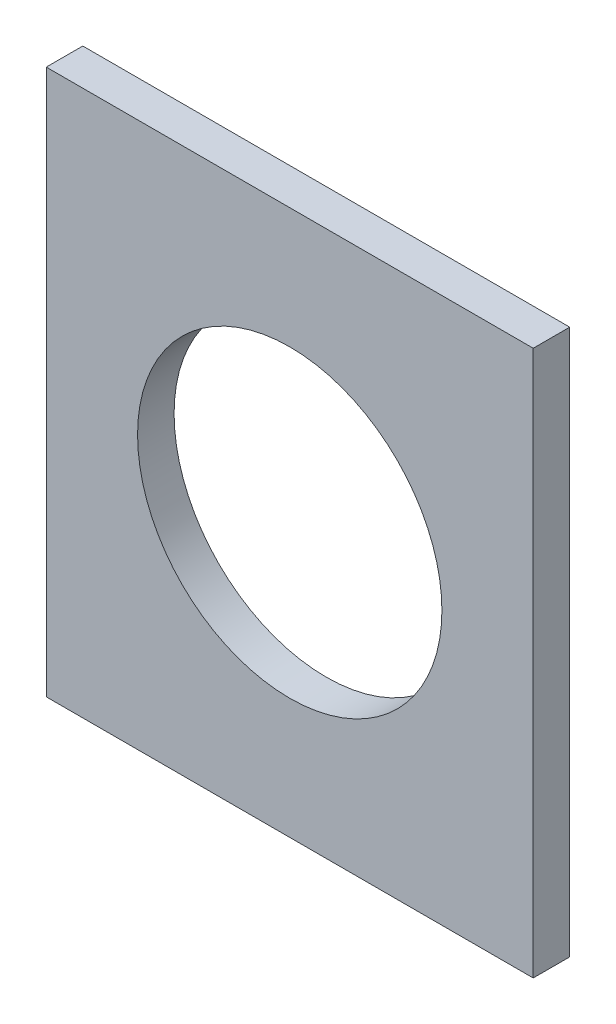
ISO-10303-21;
HEADER;
FILE_DESCRIPTION(('STEP AP214'),'2;1');
FILE_NAME('part.step','',(''),(''),'','','');
FILE_SCHEMA(('AUTOMOTIVE_DESIGN { 1 0 10303 214 1 1 1 1 }'));
ENDSEC;
DATA;
#1=APPLICATION_CONTEXT('core data for automotive mechanical design processes');
#2=APPLICATION_PROTOCOL_DEFINITION('international standard','automotive_design',2000,#1);
#3=PRODUCT_CONTEXT('',#1,'mechanical');
#4=PRODUCT('Part','Part','',(#3));
#5=PRODUCT_RELATED_PRODUCT_CATEGORY('part','',(#4));
#6=PRODUCT_DEFINITION_FORMATION('','',#4);
#7=PRODUCT_DEFINITION_CONTEXT('part definition',#1,'design');
#8=PRODUCT_DEFINITION('design','',#6,#7);
#9=PRODUCT_DEFINITION_SHAPE('','',#8);
#10=(LENGTH_UNIT() NAMED_UNIT(*) SI_UNIT(.MILLI.,.METRE.));
#11=(NAMED_UNIT(*) PLANE_ANGLE_UNIT() SI_UNIT($,.RADIAN.));
#12=(NAMED_UNIT(*) SI_UNIT($,.STERADIAN.) SOLID_ANGLE_UNIT());
#13=UNCERTAINTY_MEASURE_WITH_UNIT(LENGTH_MEASURE(1.E-05),#10,'distance_accuracy_value','');
#14=(GEOMETRIC_REPRESENTATION_CONTEXT(3) GLOBAL_UNCERTAINTY_ASSIGNED_CONTEXT((#13)) GLOBAL_UNIT_ASSIGNED_CONTEXT((#10,
#11,#12)) REPRESENTATION_CONTEXT('',''));
#15=CARTESIAN_POINT('',(0.,0.,0.));
#16=DIRECTION('',(0.,0.,1.));
#17=DIRECTION('',(1.,0.,0.));
#18=AXIS2_PLACEMENT_3D('',#15,#16,#17);
#19=CARTESIAN_POINT('',(-30.6386340917221,-28.938765294772,3.));
#20=DIRECTION('',(0.,0.,1.));
#21=DIRECTION('',(1.,0.,0.));
#22=AXIS2_PLACEMENT_3D('',#19,#20,#21);
#23=PLANE('',#22);
#24=DIRECTION('',(0.,-1.,0.));
#25=VECTOR('',#24,1.);
#26=CARTESIAN_POINT('',(-30.6386340917221,15.861234705228,3.));
#27=LINE('',#26,#25);
#28=CARTESIAN_POINT('',(-30.6386340917221,15.861234705228,3.));
#29=VERTEX_POINT('',#28);
#30=CARTESIAN_POINT('',(-30.6386340917221,-28.938765294772,3.));
#31=VERTEX_POINT('',#30);
#32=EDGE_CURVE('E85',#29,#31,#27,.T.);
#33=ORIENTED_EDGE('',*,*,#32,.T.);
#34=DIRECTION('',(1.,0.,0.));
#35=VECTOR('',#34,1.);
#36=CARTESIAN_POINT('',(-30.6386340917221,-28.938765294772,3.));
#37=LINE('',#36,#35);
#38=CARTESIAN_POINT('',(9.36136590827793,-28.938765294772,3.));
#39=VERTEX_POINT('',#38);
#40=EDGE_CURVE('E80',#31,#39,#37,.T.);
#41=ORIENTED_EDGE('',*,*,#40,.T.);
#42=DIRECTION('',(0.,1.,0.));
#43=VECTOR('',#42,1.);
#44=CARTESIAN_POINT('',(9.36136590827792,15.861234705228,3.));
#45=LINE('',#44,#43);
#46=CARTESIAN_POINT('',(9.36136590827792,15.861234705228,3.));
#47=VERTEX_POINT('',#46);
#48=EDGE_CURVE('E83',#39,#47,#45,.T.);
#49=ORIENTED_EDGE('',*,*,#48,.T.);
#50=DIRECTION('',(-1.,0.,0.));
#51=VECTOR('',#50,1.);
#52=CARTESIAN_POINT('',(-30.6386340917221,15.861234705228,3.));
#53=LINE('',#52,#51);
#54=EDGE_CURVE('E50',#47,#29,#53,.T.);
#55=ORIENTED_EDGE('',*,*,#54,.T.);
#56=EDGE_LOOP('',(#33,#41,#49,#55));
#57=FACE_BOUND('',#56,.T.);
#58=CARTESIAN_POINT('',(-10.6386340917221,-6.53876529477196,3.));
#59=DIRECTION('',(0.,0.,1.));
#60=DIRECTION('',(1.,0.,0.));
#61=AXIS2_PLACEMENT_3D('',#58,#59,#60);
#62=CIRCLE('',#61,12.5);
#63=CARTESIAN_POINT('',(1.86136590827793,-6.53876529477196,3.));
#64=VERTEX_POINT('',#63);
#65=EDGE_CURVE('E100',#64,#64,#62,.T.);
#66=ORIENTED_EDGE('',*,*,#65,.F.);
#67=EDGE_LOOP('',(#66));
#68=FACE_BOUND('',#67,.T.);
#69=ADVANCED_FACE('F33',(#57,#68),#23,.T.);
#70=CARTESIAN_POINT('',(-30.6386340917221,-28.938765294772,0.));
#71=DIRECTION('',(0.,0.,1.));
#72=DIRECTION('',(1.,0.,0.));
#73=AXIS2_PLACEMENT_3D('',#70,#71,#72);
#74=PLANE('',#73);
#75=DIRECTION('',(0.,-1.,0.));
#76=VECTOR('',#75,1.);
#77=CARTESIAN_POINT('',(-30.6386340917221,15.861234705228,0.));
#78=LINE('',#77,#76);
#79=CARTESIAN_POINT('',(-30.6386340917221,15.861234705228,0.));
#80=VERTEX_POINT('',#79);
#81=CARTESIAN_POINT('',(-30.6386340917221,-28.938765294772,0.));
#82=VERTEX_POINT('',#81);
#83=EDGE_CURVE('E97',#80,#82,#78,.T.);
#84=ORIENTED_EDGE('',*,*,#83,.F.);
#85=DIRECTION('',(-1.,0.,0.));
#86=VECTOR('',#85,1.);
#87=CARTESIAN_POINT('',(-30.6386340917221,15.861234705228,0.));
#88=LINE('',#87,#86);
#89=CARTESIAN_POINT('',(9.36136590827792,15.861234705228,0.));
#90=VERTEX_POINT('',#89);
#91=EDGE_CURVE('E73',#90,#80,#88,.T.);
#92=ORIENTED_EDGE('',*,*,#91,.F.);
#93=DIRECTION('',(0.,1.,0.));
#94=VECTOR('',#93,1.);
#95=CARTESIAN_POINT('',(9.36136590827792,15.861234705228,0.));
#96=LINE('',#95,#94);
#97=CARTESIAN_POINT('',(9.36136590827793,-28.938765294772,0.));
#98=VERTEX_POINT('',#97);
#99=EDGE_CURVE('E67',#98,#90,#96,.T.);
#100=ORIENTED_EDGE('',*,*,#99,.F.);
#101=DIRECTION('',(1.,0.,0.));
#102=VECTOR('',#101,1.);
#103=CARTESIAN_POINT('',(-30.6386340917221,-28.938765294772,0.));
#104=LINE('',#103,#102);
#105=EDGE_CURVE('E89',#82,#98,#104,.T.);
#106=ORIENTED_EDGE('',*,*,#105,.F.);
#107=EDGE_LOOP('',(#84,#92,#100,#106));
#108=FACE_BOUND('',#107,.T.);
#109=CARTESIAN_POINT('',(-10.6386340917221,-6.53876529477196,0.));
#110=DIRECTION('',(0.,0.,1.));
#111=DIRECTION('',(1.,0.,0.));
#112=AXIS2_PLACEMENT_3D('',#109,#110,#111);
#113=CIRCLE('',#112,12.5);
#114=CARTESIAN_POINT('',(1.86136590827793,-6.53876529477196,0.));
#115=VERTEX_POINT('',#114);
#116=EDGE_CURVE('E112',#115,#115,#113,.T.);
#117=ORIENTED_EDGE('',*,*,#116,.T.);
#118=EDGE_LOOP('',(#117));
#119=FACE_BOUND('',#118,.T.);
#120=ADVANCED_FACE('F108',(#108,#119),#74,.F.);
#121=CARTESIAN_POINT('',(-30.6386340917221,15.861234705228,3.));
#122=DIRECTION('',(1.,0.,0.));
#123=DIRECTION('',(0.,1.,0.));
#124=AXIS2_PLACEMENT_3D('',#121,#122,#123);
#125=PLANE('',#124);
#126=ORIENTED_EDGE('',*,*,#83,.T.);
#127=DIRECTION('',(0.,0.,-1.));
#128=VECTOR('',#127,1.);
#129=CARTESIAN_POINT('',(-30.6386340917221,-28.938765294772,3.));
#130=LINE('',#129,#128);
#131=EDGE_CURVE('E11',#31,#82,#130,.T.);
#132=ORIENTED_EDGE('',*,*,#131,.F.);
#133=ORIENTED_EDGE('',*,*,#32,.F.);
#134=DIRECTION('',(0.,0.,-1.));
#135=VECTOR('',#134,1.);
#136=CARTESIAN_POINT('',(-30.6386340917221,15.861234705228,3.));
#137=LINE('',#136,#135);
#138=EDGE_CURVE('E93',#29,#80,#137,.T.);
#139=ORIENTED_EDGE('',*,*,#138,.T.);
#140=EDGE_LOOP('',(#126,#132,#133,#139));
#141=FACE_BOUND('',#140,.T.);
#142=ADVANCED_FACE('F35',(#141),#125,.F.);
#143=CARTESIAN_POINT('',(-30.6386340917221,-28.938765294772,3.));
#144=DIRECTION('',(0.,1.,0.));
#145=DIRECTION('',(0.,0.,1.));
#146=AXIS2_PLACEMENT_3D('',#143,#144,#145);
#147=PLANE('',#146);
#148=ORIENTED_EDGE('',*,*,#105,.T.);
#149=DIRECTION('',(0.,0.,-1.));
#150=VECTOR('',#149,1.);
#151=CARTESIAN_POINT('',(9.36136590827793,-28.938765294772,3.));
#152=LINE('',#151,#150);
#153=EDGE_CURVE('E42',#39,#98,#152,.T.);
#154=ORIENTED_EDGE('',*,*,#153,.F.);
#155=ORIENTED_EDGE('',*,*,#40,.F.);
#156=ORIENTED_EDGE('',*,*,#131,.T.);
#157=EDGE_LOOP('',(#148,#154,#155,#156));
#158=FACE_BOUND('',#157,.T.);
#159=ADVANCED_FACE('F88',(#158),#147,.F.);
#160=CARTESIAN_POINT('',(9.36136590827792,15.861234705228,3.));
#161=DIRECTION('',(-1.,0.,0.));
#162=DIRECTION('',(0.,-1.,0.));
#163=AXIS2_PLACEMENT_3D('',#160,#161,#162);
#164=PLANE('',#163);
#165=ORIENTED_EDGE('',*,*,#99,.T.);
#166=DIRECTION('',(0.,0.,-1.));
#167=VECTOR('',#166,1.);
#168=CARTESIAN_POINT('',(9.36136590827792,15.861234705228,3.));
#169=LINE('',#168,#167);
#170=EDGE_CURVE('E90',#47,#90,#169,.T.);
#171=ORIENTED_EDGE('',*,*,#170,.F.);
#172=ORIENTED_EDGE('',*,*,#48,.F.);
#173=ORIENTED_EDGE('',*,*,#153,.T.);
#174=EDGE_LOOP('',(#165,#171,#172,#173));
#175=FACE_BOUND('',#174,.T.);
#176=ADVANCED_FACE('F91',(#175),#164,.F.);
#177=CARTESIAN_POINT('',(-30.6386340917221,15.861234705228,3.));
#178=DIRECTION('',(0.,-1.,0.));
#179=DIRECTION('',(0.,0.,-1.));
#180=AXIS2_PLACEMENT_3D('',#177,#178,#179);
#181=PLANE('',#180);
#182=ORIENTED_EDGE('',*,*,#91,.T.);
#183=ORIENTED_EDGE('',*,*,#138,.F.);
#184=ORIENTED_EDGE('',*,*,#54,.F.);
#185=ORIENTED_EDGE('',*,*,#170,.T.);
#186=EDGE_LOOP('',(#182,#183,#184,#185));
#187=FACE_BOUND('',#186,.T.);
#188=ADVANCED_FACE('F105',(#187),#181,.F.);
#189=CARTESIAN_POINT('',(-10.6386340917221,-6.53876529477196,3.));
#190=DIRECTION('',(0.,0.,-1.));
#191=DIRECTION('',(-1.,0.,0.));
#192=AXIS2_PLACEMENT_3D('',#189,#190,#191);
#193=CYLINDRICAL_SURFACE('',#192,12.5);
#194=ORIENTED_EDGE('',*,*,#65,.T.);
#195=EDGE_LOOP('',(#194));
#196=FACE_BOUND('',#195,.T.);
#197=ORIENTED_EDGE('',*,*,#116,.F.);
#198=EDGE_LOOP('',(#197));
#199=FACE_BOUND('',#198,.T.);
#200=ADVANCED_FACE('F118',(#196,#199),#193,.F.);
#201=CLOSED_SHELL('',(#69,#120,#142,#159,#176,#188,#200));
#202=MANIFOLD_SOLID_BREP('B2',#201);
#203=ADVANCED_BREP_SHAPE_REPRESENTATION('',(#18,#202),#14);
#204=SHAPE_DEFINITION_REPRESENTATION(#9,#203);
ENDSEC;
END-ISO-10303-21;
